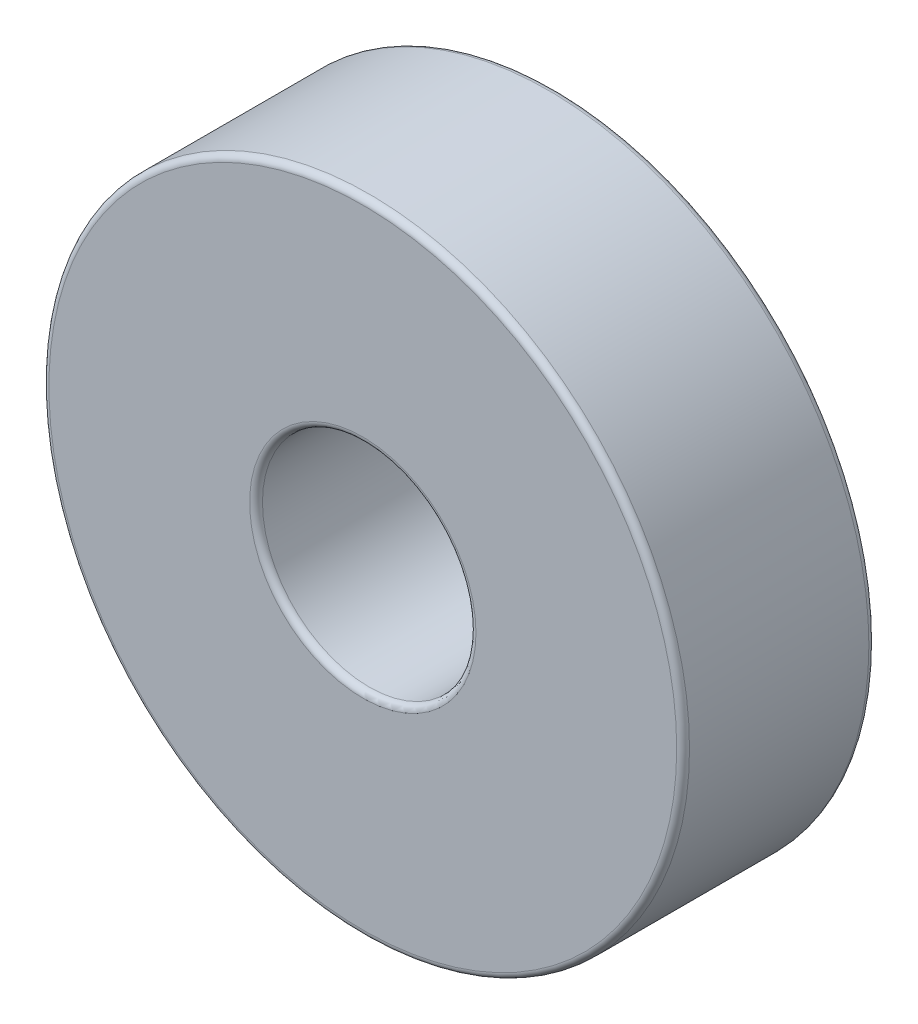
ISO-10303-21;
HEADER;
FILE_DESCRIPTION(('STEP AP214'),'2;1');
FILE_NAME('part.step','',(''),(''),'','','');
FILE_SCHEMA(('AUTOMOTIVE_DESIGN { 1 0 10303 214 1 1 1 1 }'));
ENDSEC;
DATA;
#1=APPLICATION_CONTEXT('core data for automotive mechanical design processes');
#2=APPLICATION_PROTOCOL_DEFINITION('international standard','automotive_design',2000,#1);
#3=PRODUCT_CONTEXT('',#1,'mechanical');
#4=PRODUCT('Part','Part','',(#3));
#5=PRODUCT_RELATED_PRODUCT_CATEGORY('part','',(#4));
#6=PRODUCT_DEFINITION_FORMATION('','',#4);
#7=PRODUCT_DEFINITION_CONTEXT('part definition',#1,'design');
#8=PRODUCT_DEFINITION('design','',#6,#7);
#9=PRODUCT_DEFINITION_SHAPE('','',#8);
#10=(LENGTH_UNIT() NAMED_UNIT(*) SI_UNIT(.MILLI.,.METRE.));
#11=(NAMED_UNIT(*) PLANE_ANGLE_UNIT() SI_UNIT($,.RADIAN.));
#12=(NAMED_UNIT(*) SI_UNIT($,.STERADIAN.) SOLID_ANGLE_UNIT());
#13=UNCERTAINTY_MEASURE_WITH_UNIT(LENGTH_MEASURE(1.E-05),#10,'distance_accuracy_value','');
#14=(GEOMETRIC_REPRESENTATION_CONTEXT(3) GLOBAL_UNCERTAINTY_ASSIGNED_CONTEXT((#13)) GLOBAL_UNIT_ASSIGNED_CONTEXT((#10,
#11,#12)) REPRESENTATION_CONTEXT('',''));
#15=CARTESIAN_POINT('',(0.,0.,0.));
#16=DIRECTION('',(0.,0.,1.));
#17=DIRECTION('',(1.,0.,0.));
#18=AXIS2_PLACEMENT_3D('',#15,#16,#17);
#19=CARTESIAN_POINT('',(0.,0.,9.));
#20=DIRECTION('',(0.,0.,1.));
#21=DIRECTION('',(1.,0.,0.));
#22=AXIS2_PLACEMENT_3D('',#19,#20,#21);
#23=PLANE('',#22);
#24=CARTESIAN_POINT('',(0.,0.,9.));
#25=DIRECTION('',(0.,0.,1.));
#26=DIRECTION('',(1.,0.,0.));
#27=AXIS2_PLACEMENT_3D('',#24,#25,#26);
#28=CIRCLE('',#27,5.3);
#29=CARTESIAN_POINT('',(5.3,0.,9.));
#30=VERTEX_POINT('',#29);
#31=EDGE_CURVE('E10',#30,#30,#28,.F.);
#32=ORIENTED_EDGE('',*,*,#31,.T.);
#33=EDGE_LOOP('',(#32));
#34=FACE_BOUND('',#33,.T.);
#35=CARTESIAN_POINT('',(0.,0.,9.));
#36=DIRECTION('',(0.,0.,1.));
#37=DIRECTION('',(1.,0.,0.));
#38=AXIS2_PLACEMENT_3D('',#35,#36,#37);
#39=CIRCLE('',#38,14.7);
#40=CARTESIAN_POINT('',(14.7,0.,9.));
#41=VERTEX_POINT('',#40);
#42=EDGE_CURVE('E37',#41,#41,#39,.T.);
#43=ORIENTED_EDGE('',*,*,#42,.T.);
#44=EDGE_LOOP('',(#43));
#45=FACE_BOUND('',#44,.T.);
#46=ADVANCED_FACE('F30',(#34,#45),#23,.T.);
#47=CARTESIAN_POINT('',(0.,0.,0.));
#48=DIRECTION('',(0.,0.,1.));
#49=DIRECTION('',(1.,0.,0.));
#50=AXIS2_PLACEMENT_3D('',#47,#48,#49);
#51=PLANE('',#50);
#52=CARTESIAN_POINT('',(0.,0.,0.));
#53=DIRECTION('',(0.,0.,1.));
#54=DIRECTION('',(1.,0.,0.));
#55=AXIS2_PLACEMENT_3D('',#52,#53,#54);
#56=CIRCLE('',#55,5.3);
#57=CARTESIAN_POINT('',(5.3,0.,0.));
#58=VERTEX_POINT('',#57);
#59=EDGE_CURVE('E56',#58,#58,#56,.T.);
#60=ORIENTED_EDGE('',*,*,#59,.T.);
#61=EDGE_LOOP('',(#60));
#62=FACE_BOUND('',#61,.T.);
#63=CARTESIAN_POINT('',(0.,0.,0.));
#64=DIRECTION('',(0.,0.,1.));
#65=DIRECTION('',(1.,0.,0.));
#66=AXIS2_PLACEMENT_3D('',#63,#64,#65);
#67=CIRCLE('',#66,14.7);
#68=CARTESIAN_POINT('',(14.7,0.,0.));
#69=VERTEX_POINT('',#68);
#70=EDGE_CURVE('E59',#69,#69,#67,.F.);
#71=ORIENTED_EDGE('',*,*,#70,.T.);
#72=EDGE_LOOP('',(#71));
#73=FACE_BOUND('',#72,.T.);
#74=ADVANCED_FACE('F63',(#62,#73),#51,.F.);
#75=CARTESIAN_POINT('',(0.,0.,9.));
#76=DIRECTION('',(0.,0.,-1.));
#77=DIRECTION('',(-1.,0.,0.));
#78=AXIS2_PLACEMENT_3D('',#75,#76,#77);
#79=CYLINDRICAL_SURFACE('',#78,15.);
#80=CARTESIAN_POINT('',(0.,0.,0.3));
#81=DIRECTION('',(0.,0.,1.));
#82=DIRECTION('',(1.,0.,0.));
#83=AXIS2_PLACEMENT_3D('',#80,#81,#82);
#84=CIRCLE('',#83,15.);
#85=CARTESIAN_POINT('',(15.,0.,0.3));
#86=VERTEX_POINT('',#85);
#87=EDGE_CURVE('E41',#86,#86,#84,.T.);
#88=ORIENTED_EDGE('',*,*,#87,.T.);
#89=EDGE_LOOP('',(#88));
#90=FACE_BOUND('',#89,.T.);
#91=CARTESIAN_POINT('',(0.,0.,8.7));
#92=DIRECTION('',(0.,0.,1.));
#93=DIRECTION('',(1.,0.,0.));
#94=AXIS2_PLACEMENT_3D('',#91,#92,#93);
#95=CIRCLE('',#94,15.);
#96=CARTESIAN_POINT('',(15.,0.,8.7));
#97=VERTEX_POINT('',#96);
#98=EDGE_CURVE('E45',#97,#97,#95,.F.);
#99=ORIENTED_EDGE('',*,*,#98,.T.);
#100=EDGE_LOOP('',(#99));
#101=FACE_BOUND('',#100,.T.);
#102=ADVANCED_FACE('F73',(#90,#101),#79,.T.);
#103=CARTESIAN_POINT('',(0.,0.,9.));
#104=DIRECTION('',(0.,0.,-1.));
#105=DIRECTION('',(-1.,0.,0.));
#106=AXIS2_PLACEMENT_3D('',#103,#104,#105);
#107=CYLINDRICAL_SURFACE('',#106,5.);
#108=CARTESIAN_POINT('',(0.,0.,0.3));
#109=DIRECTION('',(0.,0.,1.));
#110=DIRECTION('',(1.,0.,0.));
#111=AXIS2_PLACEMENT_3D('',#108,#109,#110);
#112=CIRCLE('',#111,5.);
#113=CARTESIAN_POINT('',(5.,0.,0.3));
#114=VERTEX_POINT('',#113);
#115=EDGE_CURVE('E50',#114,#114,#112,.F.);
#116=ORIENTED_EDGE('',*,*,#115,.T.);
#117=EDGE_LOOP('',(#116));
#118=FACE_BOUND('',#117,.T.);
#119=CARTESIAN_POINT('',(0.,0.,8.7));
#120=DIRECTION('',(0.,0.,1.));
#121=DIRECTION('',(1.,0.,0.));
#122=AXIS2_PLACEMENT_3D('',#119,#120,#121);
#123=CIRCLE('',#122,5.);
#124=CARTESIAN_POINT('',(5.,0.,8.7));
#125=VERTEX_POINT('',#124);
#126=EDGE_CURVE('E53',#125,#125,#123,.T.);
#127=ORIENTED_EDGE('',*,*,#126,.T.);
#128=EDGE_LOOP('',(#127));
#129=FACE_BOUND('',#128,.T.);
#130=ADVANCED_FACE('F76',(#118,#129),#107,.F.);
#131=CARTESIAN_POINT('',(0.,0.,0.3));
#132=DIRECTION('',(0.,0.,1.));
#133=DIRECTION('',(1.,0.,0.));
#134=AXIS2_PLACEMENT_3D('',#131,#132,#133);
#135=TOROIDAL_SURFACE('',#134,5.3,0.3);
#136=ORIENTED_EDGE('',*,*,#115,.F.);
#137=EDGE_LOOP('',(#136));
#138=FACE_BOUND('',#137,.T.);
#139=ORIENTED_EDGE('',*,*,#59,.F.);
#140=EDGE_LOOP('',(#139));
#141=FACE_BOUND('',#140,.T.);
#142=ADVANCED_FACE('F69',(#138,#141),#135,.T.);
#143=CARTESIAN_POINT('',(0.,0.,0.3));
#144=DIRECTION('',(0.,0.,1.));
#145=DIRECTION('',(1.,0.,0.));
#146=AXIS2_PLACEMENT_3D('',#143,#144,#145);
#147=TOROIDAL_SURFACE('',#146,14.7,0.3);
#148=ORIENTED_EDGE('',*,*,#70,.F.);
#149=EDGE_LOOP('',(#148));
#150=FACE_BOUND('',#149,.T.);
#151=ORIENTED_EDGE('',*,*,#87,.F.);
#152=EDGE_LOOP('',(#151));
#153=FACE_BOUND('',#152,.T.);
#154=ADVANCED_FACE('F65',(#150,#153),#147,.T.);
#155=CARTESIAN_POINT('',(0.,0.,8.7));
#156=DIRECTION('',(0.,0.,1.));
#157=DIRECTION('',(1.,0.,0.));
#158=AXIS2_PLACEMENT_3D('',#155,#156,#157);
#159=TOROIDAL_SURFACE('',#158,5.3,0.3);
#160=ORIENTED_EDGE('',*,*,#31,.F.);
#161=EDGE_LOOP('',(#160));
#162=FACE_BOUND('',#161,.T.);
#163=ORIENTED_EDGE('',*,*,#126,.F.);
#164=EDGE_LOOP('',(#163));
#165=FACE_BOUND('',#164,.T.);
#166=ADVANCED_FACE('F68',(#162,#165),#159,.T.);
#167=CARTESIAN_POINT('',(0.,0.,8.7));
#168=DIRECTION('',(0.,0.,1.));
#169=DIRECTION('',(1.,0.,0.));
#170=AXIS2_PLACEMENT_3D('',#167,#168,#169);
#171=TOROIDAL_SURFACE('',#170,14.7,0.3);
#172=ORIENTED_EDGE('',*,*,#98,.F.);
#173=EDGE_LOOP('',(#172));
#174=FACE_BOUND('',#173,.T.);
#175=ORIENTED_EDGE('',*,*,#42,.F.);
#176=EDGE_LOOP('',(#175));
#177=FACE_BOUND('',#176,.T.);
#178=ADVANCED_FACE('F32',(#174,#177),#171,.T.);
#179=CLOSED_SHELL('',(#46,#74,#102,#130,#142,#154,#166,#178));
#180=MANIFOLD_SOLID_BREP('B2',#179);
#181=ADVANCED_BREP_SHAPE_REPRESENTATION('',(#18,#180),#14);
#182=SHAPE_DEFINITION_REPRESENTATION(#9,#181);
ENDSEC;
END-ISO-10303-21;
